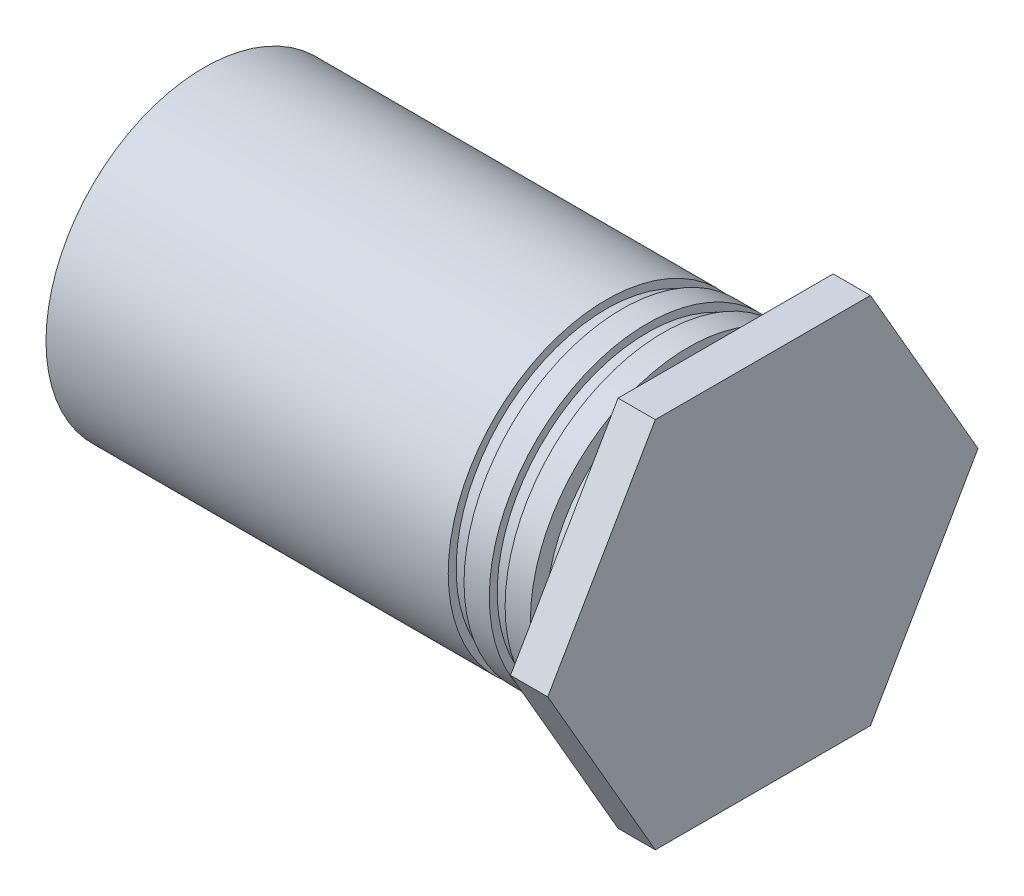
ISO-10303-21;
HEADER;
FILE_DESCRIPTION(('STEP AP214'),'2;1');
FILE_NAME('part.step','',(''),(''),'','','');
FILE_SCHEMA(('AUTOMOTIVE_DESIGN { 1 0 10303 214 1 1 1 1 }'));
ENDSEC;
DATA;
#1=APPLICATION_CONTEXT('core data for automotive mechanical design processes');
#2=APPLICATION_PROTOCOL_DEFINITION('international standard','automotive_design',2000,#1);
#3=PRODUCT_CONTEXT('',#1,'mechanical');
#4=PRODUCT('Part','Part','',(#3));
#5=PRODUCT_RELATED_PRODUCT_CATEGORY('part','',(#4));
#6=PRODUCT_DEFINITION_FORMATION('','',#4);
#7=PRODUCT_DEFINITION_CONTEXT('part definition',#1,'design');
#8=PRODUCT_DEFINITION('design','',#6,#7);
#9=PRODUCT_DEFINITION_SHAPE('','',#8);
#10=(LENGTH_UNIT() NAMED_UNIT(*) SI_UNIT(.MILLI.,.METRE.));
#11=(NAMED_UNIT(*) PLANE_ANGLE_UNIT() SI_UNIT($,.RADIAN.));
#12=(NAMED_UNIT(*) SI_UNIT($,.STERADIAN.) SOLID_ANGLE_UNIT());
#13=UNCERTAINTY_MEASURE_WITH_UNIT(LENGTH_MEASURE(1.E-05),#10,'distance_accuracy_value','');
#14=(GEOMETRIC_REPRESENTATION_CONTEXT(3) GLOBAL_UNCERTAINTY_ASSIGNED_CONTEXT((#13)) GLOBAL_UNIT_ASSIGNED_CONTEXT((#10,
#11,#12)) REPRESENTATION_CONTEXT('',''));
#15=CARTESIAN_POINT('',(0.,0.,0.));
#16=DIRECTION('',(0.,0.,1.));
#17=DIRECTION('',(1.,0.,0.));
#18=AXIS2_PLACEMENT_3D('',#15,#16,#17);
#19=CARTESIAN_POINT('',(0.635,0.,0.));
#20=DIRECTION('',(1.,0.,0.));
#21=DIRECTION('',(0.,1.,0.));
#22=AXIS2_PLACEMENT_3D('',#19,#20,#21);
#23=PLANE('',#22);
#24=DIRECTION('',(0.,0.866025403784438,-0.5));
#25=VECTOR('',#24,1.);
#26=CARTESIAN_POINT('',(0.635,0.,-3.66617420935413));
#27=LINE('',#26,#25);
#28=CARTESIAN_POINT('',(0.635,0.,-3.66617420935413));
#29=VERTEX_POINT('',#28);
#30=CARTESIAN_POINT('',(0.635,-3.175,-1.83308710467706));
#31=VERTEX_POINT('',#30);
#32=EDGE_CURVE('E83',#29,#31,#27,.F.);
#33=ORIENTED_EDGE('',*,*,#32,.F.);
#34=DIRECTION('',(0.,0.866025403784439,0.5));
#35=VECTOR('',#34,1.);
#36=CARTESIAN_POINT('',(0.635,3.175,-1.83308710467706));
#37=LINE('',#36,#35);
#38=CARTESIAN_POINT('',(0.635,3.175,-1.83308710467706));
#39=VERTEX_POINT('',#38);
#40=EDGE_CURVE('E167',#39,#29,#37,.F.);
#41=ORIENTED_EDGE('',*,*,#40,.F.);
#42=DIRECTION('',(0.,0.,1.));
#43=VECTOR('',#42,1.);
#44=CARTESIAN_POINT('',(0.635,3.175,1.83308710467706));
#45=LINE('',#44,#43);
#46=CARTESIAN_POINT('',(0.635,3.175,1.83308710467706));
#47=VERTEX_POINT('',#46);
#48=EDGE_CURVE('E161',#47,#39,#45,.F.);
#49=ORIENTED_EDGE('',*,*,#48,.F.);
#50=DIRECTION('',(0.,-0.866025403784439,0.5));
#51=VECTOR('',#50,1.);
#52=CARTESIAN_POINT('',(0.635,0.,3.66617420935412));
#53=LINE('',#52,#51);
#54=CARTESIAN_POINT('',(0.635,0.,3.66617420935412));
#55=VERTEX_POINT('',#54);
#56=EDGE_CURVE('E72',#55,#47,#53,.F.);
#57=ORIENTED_EDGE('',*,*,#56,.F.);
#58=DIRECTION('',(0.,-0.866025403784439,-0.5));
#59=VECTOR('',#58,1.);
#60=CARTESIAN_POINT('',(0.635,-3.175,1.83308710467706));
#61=LINE('',#60,#59);
#62=CARTESIAN_POINT('',(0.635,-3.175,1.83308710467706));
#63=VERTEX_POINT('',#62);
#64=EDGE_CURVE('E69',#63,#55,#61,.F.);
#65=ORIENTED_EDGE('',*,*,#64,.F.);
#66=DIRECTION('',(0.,0.,-1.));
#67=VECTOR('',#66,1.);
#68=CARTESIAN_POINT('',(0.635,-3.175,-1.83308710467706));
#69=LINE('',#68,#67);
#70=EDGE_CURVE('E66',#31,#63,#69,.F.);
#71=ORIENTED_EDGE('',*,*,#70,.F.);
#72=EDGE_LOOP('',(#33,#41,#49,#57,#65,#71));
#73=FACE_BOUND('',#72,.T.);
#74=ADVANCED_FACE('F17',(#73),#23,.T.);
#75=CARTESIAN_POINT('',(0.,-3.175,1.83308710467706));
#76=DIRECTION('',(0.,-0.5,0.866025403784439));
#77=DIRECTION('',(0.,-0.866025403784439,-0.5));
#78=AXIS2_PLACEMENT_3D('',#75,#76,#77);
#79=PLANE('',#78);
#80=DIRECTION('',(0.,-0.866025403784439,-0.5));
#81=VECTOR('',#80,1.);
#82=CARTESIAN_POINT('',(0.,0.,3.66617420935412));
#83=LINE('',#82,#81);
#84=CARTESIAN_POINT('',(0.,0.,3.66617420935412));
#85=VERTEX_POINT('',#84);
#86=CARTESIAN_POINT('',(0.,-3.175,1.83308710467706));
#87=VERTEX_POINT('',#86);
#88=EDGE_CURVE('E80',#85,#87,#83,.T.);
#89=ORIENTED_EDGE('',*,*,#88,.T.);
#90=DIRECTION('',(1.,0.,0.));
#91=VECTOR('',#90,1.);
#92=CARTESIAN_POINT('',(0.,-3.175,1.83308710467706));
#93=LINE('',#92,#91);
#94=EDGE_CURVE('E77',#63,#87,#93,.F.);
#95=ORIENTED_EDGE('',*,*,#94,.F.);
#96=ORIENTED_EDGE('',*,*,#64,.T.);
#97=DIRECTION('',(1.,0.,0.));
#98=VECTOR('',#97,1.);
#99=CARTESIAN_POINT('',(0.,0.,3.66617420935412));
#100=LINE('',#99,#98);
#101=EDGE_CURVE('E153',#85,#55,#100,.T.);
#102=ORIENTED_EDGE('',*,*,#101,.F.);
#103=EDGE_LOOP('',(#89,#95,#96,#102));
#104=FACE_BOUND('',#103,.T.);
#105=ADVANCED_FACE('F78',(#104),#79,.T.);
#106=CARTESIAN_POINT('',(0.,-3.175,-1.83308710467706));
#107=DIRECTION('',(0.,-1.,0.));
#108=DIRECTION('',(0.,0.,-1.));
#109=AXIS2_PLACEMENT_3D('',#106,#107,#108);
#110=PLANE('',#109);
#111=DIRECTION('',(0.,0.,1.));
#112=VECTOR('',#111,1.);
#113=CARTESIAN_POINT('',(0.,-3.175,0.));
#114=LINE('',#113,#112);
#115=CARTESIAN_POINT('',(0.,-3.175,-1.83308710467706));
#116=VERTEX_POINT('',#115);
#117=EDGE_CURVE('E150',#87,#116,#114,.F.);
#118=ORIENTED_EDGE('',*,*,#117,.T.);
#119=DIRECTION('',(1.,0.,0.));
#120=VECTOR('',#119,1.);
#121=CARTESIAN_POINT('',(0.,-3.175,-1.83308710467707));
#122=LINE('',#121,#120);
#123=EDGE_CURVE('E87',#31,#116,#122,.F.);
#124=ORIENTED_EDGE('',*,*,#123,.F.);
#125=ORIENTED_EDGE('',*,*,#70,.T.);
#126=ORIENTED_EDGE('',*,*,#94,.T.);
#127=EDGE_LOOP('',(#118,#124,#125,#126));
#128=FACE_BOUND('',#127,.T.);
#129=ADVANCED_FACE('F85',(#128),#110,.T.);
#130=CARTESIAN_POINT('',(0.,0.,-3.66617420935413));
#131=DIRECTION('',(0.,-0.5,-0.866025403784438));
#132=DIRECTION('',(0.,0.866025403784438,-0.5));
#133=AXIS2_PLACEMENT_3D('',#130,#131,#132);
#134=PLANE('',#133);
#135=DIRECTION('',(0.,0.866025403784438,-0.500000000000002));
#136=VECTOR('',#135,1.);
#137=CARTESIAN_POINT('',(0.,-3.175,-1.83308710467706));
#138=LINE('',#137,#136);
#139=CARTESIAN_POINT('',(0.,0.,-3.66617420935413));
#140=VERTEX_POINT('',#139);
#141=EDGE_CURVE('E148',#116,#140,#138,.T.);
#142=ORIENTED_EDGE('',*,*,#141,.T.);
#143=DIRECTION('',(1.,0.,0.));
#144=VECTOR('',#143,1.);
#145=CARTESIAN_POINT('',(0.,0.,-3.66617420935412));
#146=LINE('',#145,#144);
#147=EDGE_CURVE('E164',#29,#140,#146,.F.);
#148=ORIENTED_EDGE('',*,*,#147,.F.);
#149=ORIENTED_EDGE('',*,*,#32,.T.);
#150=ORIENTED_EDGE('',*,*,#123,.T.);
#151=EDGE_LOOP('',(#142,#148,#149,#150));
#152=FACE_BOUND('',#151,.T.);
#153=ADVANCED_FACE('F172',(#152),#134,.T.);
#154=CARTESIAN_POINT('',(0.,3.175,-1.83308710467706));
#155=DIRECTION('',(0.,0.5,-0.866025403784439));
#156=DIRECTION('',(0.,0.866025403784439,0.5));
#157=AXIS2_PLACEMENT_3D('',#154,#155,#156);
#158=PLANE('',#157);
#159=DIRECTION('',(0.,0.866025403784438,0.500000000000001));
#160=VECTOR('',#159,1.);
#161=CARTESIAN_POINT('',(0.,0.,-3.66617420935413));
#162=LINE('',#161,#160);
#163=CARTESIAN_POINT('',(0.,3.175,-1.83308710467706));
#164=VERTEX_POINT('',#163);
#165=EDGE_CURVE('E142',#140,#164,#162,.T.);
#166=ORIENTED_EDGE('',*,*,#165,.T.);
#167=DIRECTION('',(1.,0.,0.));
#168=VECTOR('',#167,1.);
#169=CARTESIAN_POINT('',(0.,3.175,-1.83308710467706));
#170=LINE('',#169,#168);
#171=EDGE_CURVE('E158',#39,#164,#170,.F.);
#172=ORIENTED_EDGE('',*,*,#171,.F.);
#173=ORIENTED_EDGE('',*,*,#40,.T.);
#174=ORIENTED_EDGE('',*,*,#147,.T.);
#175=EDGE_LOOP('',(#166,#172,#173,#174));
#176=FACE_BOUND('',#175,.T.);
#177=ADVANCED_FACE('F177',(#176),#158,.T.);
#178=CARTESIAN_POINT('',(0.,3.175,1.83308710467706));
#179=DIRECTION('',(0.,1.,0.));
#180=DIRECTION('',(0.,0.,1.));
#181=AXIS2_PLACEMENT_3D('',#178,#179,#180);
#182=PLANE('',#181);
#183=DIRECTION('',(0.,0.,1.));
#184=VECTOR('',#183,1.);
#185=CARTESIAN_POINT('',(0.,3.175,0.));
#186=LINE('',#185,#184);
#187=CARTESIAN_POINT('',(0.,3.175,1.83308710467706));
#188=VERTEX_POINT('',#187);
#189=EDGE_CURVE('E137',#164,#188,#186,.T.);
#190=ORIENTED_EDGE('',*,*,#189,.T.);
#191=DIRECTION('',(1.,0.,0.));
#192=VECTOR('',#191,1.);
#193=CARTESIAN_POINT('',(0.,3.175,1.83308710467706));
#194=LINE('',#193,#192);
#195=EDGE_CURVE('E155',#47,#188,#194,.F.);
#196=ORIENTED_EDGE('',*,*,#195,.F.);
#197=ORIENTED_EDGE('',*,*,#48,.T.);
#198=ORIENTED_EDGE('',*,*,#171,.T.);
#199=EDGE_LOOP('',(#190,#196,#197,#198));
#200=FACE_BOUND('',#199,.T.);
#201=ADVANCED_FACE('F181',(#200),#182,.T.);
#202=CARTESIAN_POINT('',(0.,0.,3.66617420935412));
#203=DIRECTION('',(0.,0.5,0.866025403784439));
#204=DIRECTION('',(0.,-0.866025403784439,0.5));
#205=AXIS2_PLACEMENT_3D('',#202,#203,#204);
#206=PLANE('',#205);
#207=DIRECTION('',(0.,-0.866025403784439,0.5));
#208=VECTOR('',#207,1.);
#209=CARTESIAN_POINT('',(0.,3.175,1.83308710467706));
#210=LINE('',#209,#208);
#211=EDGE_CURVE('E133',#188,#85,#210,.T.);
#212=ORIENTED_EDGE('',*,*,#211,.T.);
#213=ORIENTED_EDGE('',*,*,#101,.T.);
#214=ORIENTED_EDGE('',*,*,#56,.T.);
#215=ORIENTED_EDGE('',*,*,#195,.T.);
#216=EDGE_LOOP('',(#212,#213,#214,#215));
#217=FACE_BOUND('',#216,.T.);
#218=ADVANCED_FACE('F182',(#217),#206,.T.);
#219=CARTESIAN_POINT('',(0.,0.,0.));
#220=DIRECTION('',(1.,0.,0.));
#221=DIRECTION('',(0.,1.,0.));
#222=AXIS2_PLACEMENT_3D('',#219,#220,#221);
#223=PLANE('',#222);
#224=CARTESIAN_POINT('',(0.,0.,0.));
#225=DIRECTION('',(1.,0.,0.));
#226=DIRECTION('',(0.,0.,-1.));
#227=AXIS2_PLACEMENT_3D('',#224,#225,#226);
#228=CIRCLE('',#227,2.42316);
#229=CARTESIAN_POINT('',(0.,0.,-2.42316));
#230=VERTEX_POINT('',#229);
#231=EDGE_CURVE('E20',#230,#230,#228,.F.);
#232=ORIENTED_EDGE('',*,*,#231,.F.);
#233=EDGE_LOOP('',(#232));
#234=FACE_BOUND('',#233,.T.);
#235=ORIENTED_EDGE('',*,*,#189,.F.);
#236=ORIENTED_EDGE('',*,*,#165,.F.);
#237=ORIENTED_EDGE('',*,*,#141,.F.);
#238=ORIENTED_EDGE('',*,*,#117,.F.);
#239=ORIENTED_EDGE('',*,*,#88,.F.);
#240=ORIENTED_EDGE('',*,*,#211,.F.);
#241=EDGE_LOOP('',(#235,#236,#237,#238,#239,#240));
#242=FACE_BOUND('',#241,.T.);
#243=ADVANCED_FACE('F184',(#234,#242),#223,.F.);
#244=CARTESIAN_POINT('',(-0.3175,0.,0.));
#245=DIRECTION('',(1.,0.,0.));
#246=DIRECTION('',(0.,0.,-1.));
#247=AXIS2_PLACEMENT_3D('',#244,#245,#246);
#248=CYLINDRICAL_SURFACE('',#247,2.42316);
#249=CARTESIAN_POINT('',(-0.635,0.,0.));
#250=DIRECTION('',(1.,0.,0.));
#251=DIRECTION('',(0.,0.,-1.));
#252=AXIS2_PLACEMENT_3D('',#249,#250,#251);
#253=CIRCLE('',#252,2.42316);
#254=CARTESIAN_POINT('',(-0.634999999999999,0.,-2.42316));
#255=VERTEX_POINT('',#254);
#256=EDGE_CURVE('E128',#255,#255,#253,.F.);
#257=ORIENTED_EDGE('',*,*,#256,.F.);
#258=EDGE_LOOP('',(#257));
#259=FACE_BOUND('',#258,.T.);
#260=ORIENTED_EDGE('',*,*,#231,.T.);
#261=EDGE_LOOP('',(#260));
#262=FACE_BOUND('',#261,.T.);
#263=ADVANCED_FACE('F191',(#259,#262),#248,.T.);
#264=CARTESIAN_POINT('',(-0.635,0.,1.3462));
#265=DIRECTION('',(1.,0.,0.));
#266=DIRECTION('',(0.,0.,-1.));
#267=AXIS2_PLACEMENT_3D('',#264,#265,#266);
#268=PLANE('',#267);
#269=CARTESIAN_POINT('',(-0.635000000000001,0.,0.));
#270=DIRECTION('',(1.,0.,0.));
#271=DIRECTION('',(0.,0.,-1.));
#272=AXIS2_PLACEMENT_3D('',#269,#270,#271);
#273=CIRCLE('',#272,2.6924);
#274=CARTESIAN_POINT('',(-0.635,0.,-2.6924));
#275=VERTEX_POINT('',#274);
#276=EDGE_CURVE('E126',#275,#275,#273,.F.);
#277=ORIENTED_EDGE('',*,*,#276,.F.);
#278=EDGE_LOOP('',(#277));
#279=FACE_BOUND('',#278,.T.);
#280=ORIENTED_EDGE('',*,*,#256,.T.);
#281=EDGE_LOOP('',(#280));
#282=FACE_BOUND('',#281,.T.);
#283=ADVANCED_FACE('F258',(#279,#282),#268,.T.);
#284=CARTESIAN_POINT('',(-4.7625,0.,0.));
#285=DIRECTION('',(1.,0.,0.));
#286=DIRECTION('',(0.,0.,-1.));
#287=AXIS2_PLACEMENT_3D('',#284,#285,#286);
#288=CYLINDRICAL_SURFACE('',#287,2.6924);
#289=CARTESIAN_POINT('',(-1.065784,0.,0.));
#290=DIRECTION('',(1.,0.,0.));
#291=DIRECTION('',(0.,0.,-1.));
#292=AXIS2_PLACEMENT_3D('',#289,#290,#291);
#293=CIRCLE('',#292,2.6924);
#294=CARTESIAN_POINT('',(-1.065784,0.,-2.6924));
#295=VERTEX_POINT('',#294);
#296=EDGE_CURVE('E123',#295,#295,#293,.T.);
#297=ORIENTED_EDGE('',*,*,#296,.T.);
#298=EDGE_LOOP('',(#297));
#299=FACE_BOUND('',#298,.T.);
#300=ORIENTED_EDGE('',*,*,#276,.T.);
#301=EDGE_LOOP('',(#300));
#302=FACE_BOUND('',#301,.T.);
#303=ADVANCED_FACE('F254',(#299,#302),#288,.T.);
#304=CARTESIAN_POINT('',(-1.065784,0.,2.62509));
#305=DIRECTION('',(1.,0.,0.));
#306=DIRECTION('',(0.,0.,-1.));
#307=AXIS2_PLACEMENT_3D('',#304,#305,#306);
#308=PLANE('',#307);
#309=ORIENTED_EDGE('',*,*,#296,.F.);
#310=EDGE_LOOP('',(#309));
#311=FACE_BOUND('',#310,.T.);
#312=CARTESIAN_POINT('',(-1.065784,0.,0.));
#313=DIRECTION('',(1.,0.,0.));
#314=DIRECTION('',(0.,0.,-1.));
#315=AXIS2_PLACEMENT_3D('',#312,#313,#314);
#316=CIRCLE('',#315,2.55778);
#317=CARTESIAN_POINT('',(-1.065784,0.,-2.55778));
#318=VERTEX_POINT('',#317);
#319=EDGE_CURVE('E120',#318,#318,#316,.F.);
#320=ORIENTED_EDGE('',*,*,#319,.F.);
#321=EDGE_LOOP('',(#320));
#322=FACE_BOUND('',#321,.T.);
#323=ADVANCED_FACE('F250',(#311,#322),#308,.F.);
#324=CARTESIAN_POINT('',(-1.200404,0.,0.));
#325=DIRECTION('',(1.,0.,0.));
#326=DIRECTION('',(0.,0.,-1.));
#327=AXIS2_PLACEMENT_3D('',#324,#325,#326);
#328=CYLINDRICAL_SURFACE('',#327,2.55778);
#329=CARTESIAN_POINT('',(-1.335024,0.,0.));
#330=DIRECTION('',(1.,0.,0.));
#331=DIRECTION('',(0.,0.,-1.));
#332=AXIS2_PLACEMENT_3D('',#329,#330,#331);
#333=CIRCLE('',#332,2.55778);
#334=CARTESIAN_POINT('',(-1.335024,0.,-2.55778));
#335=VERTEX_POINT('',#334);
#336=EDGE_CURVE('E117',#335,#335,#333,.T.);
#337=ORIENTED_EDGE('',*,*,#336,.T.);
#338=EDGE_LOOP('',(#337));
#339=FACE_BOUND('',#338,.T.);
#340=ORIENTED_EDGE('',*,*,#319,.T.);
#341=EDGE_LOOP('',(#340));
#342=FACE_BOUND('',#341,.T.);
#343=ADVANCED_FACE('F246',(#339,#342),#328,.T.);
#344=CARTESIAN_POINT('',(-2.14630000010629,0.,0.));
#345=DIRECTION('',(-1.,0.,0.));
#346=DIRECTION('',(0.,-1.,0.));
#347=AXIS2_PLACEMENT_3D('',#344,#345,#346);
#348=CONICAL_SURFACE('',#347,1.32334000005585,1.04719755119264);
#349=CARTESIAN_POINT('',(-2.1463,0.,0.));
#350=DIRECTION('',(-1.,0.,0.));
#351=DIRECTION('',(0.,-1.,0.));
#352=AXIS2_PLACEMENT_3D('',#349,#350,#351);
#353=CIRCLE('',#352,1.32334);
#354=CARTESIAN_POINT('',(-2.1463,-1.32334,0.));
#355=VERTEX_POINT('',#354);
#356=EDGE_CURVE('E116',#355,#355,#353,.T.);
#357=ORIENTED_EDGE('',*,*,#356,.T.);
#358=EDGE_LOOP('',(#357));
#359=FACE_BOUND('',#358,.T.);
#360=CARTESIAN_POINT('',(-1.3822692949077,0.,-2.84212926676294E-11));
#361=VERTEX_POINT('',#360);
#362=VERTEX_LOOP('',#361);
#363=FACE_BOUND('',#362,.T.);
#364=ADVANCED_FACE('F242',(#359,#363),#348,.F.);
#365=CARTESIAN_POINT('',(-1.335024,0.,2.62509));
#366=DIRECTION('',(-1.,0.,0.));
#367=DIRECTION('',(0.,0.,1.));
#368=AXIS2_PLACEMENT_3D('',#365,#366,#367);
#369=PLANE('',#368);
#370=ORIENTED_EDGE('',*,*,#336,.F.);
#371=EDGE_LOOP('',(#370));
#372=FACE_BOUND('',#371,.T.);
#373=CARTESIAN_POINT('',(-1.335024,0.,0.));
#374=DIRECTION('',(1.,0.,0.));
#375=DIRECTION('',(0.,0.,-1.));
#376=AXIS2_PLACEMENT_3D('',#373,#374,#375);
#377=CIRCLE('',#376,2.6924);
#378=CARTESIAN_POINT('',(-1.335024,0.,-2.6924));
#379=VERTEX_POINT('',#378);
#380=EDGE_CURVE('E113',#379,#379,#377,.F.);
#381=ORIENTED_EDGE('',*,*,#380,.F.);
#382=EDGE_LOOP('',(#381));
#383=FACE_BOUND('',#382,.T.);
#384=ADVANCED_FACE('F238',(#372,#383),#369,.F.);
#385=CARTESIAN_POINT('',(-3.53695,0.,0.));
#386=DIRECTION('',(-1.,0.,0.));
#387=DIRECTION('',(0.,-1.,0.));
#388=AXIS2_PLACEMENT_3D('',#385,#386,#387);
#389=CYLINDRICAL_SURFACE('',#388,1.32334);
#390=ORIENTED_EDGE('',*,*,#356,.F.);
#391=EDGE_LOOP('',(#390));
#392=FACE_BOUND('',#391,.T.);
#393=CARTESIAN_POINT('',(-4.9276,0.,0.));
#394=DIRECTION('',(-1.,0.,0.));
#395=DIRECTION('',(0.,-1.,0.));
#396=AXIS2_PLACEMENT_3D('',#393,#394,#395);
#397=CIRCLE('',#396,1.32334);
#398=CARTESIAN_POINT('',(-4.9276,-1.32334,0.));
#399=VERTEX_POINT('',#398);
#400=EDGE_CURVE('E110',#399,#399,#397,.F.);
#401=ORIENTED_EDGE('',*,*,#400,.F.);
#402=EDGE_LOOP('',(#401));
#403=FACE_BOUND('',#402,.T.);
#404=ADVANCED_FACE('F234',(#392,#403),#389,.F.);
#405=CARTESIAN_POINT('',(-4.7625,0.,0.));
#406=DIRECTION('',(1.,0.,0.));
#407=DIRECTION('',(0.,0.,-1.));
#408=AXIS2_PLACEMENT_3D('',#405,#406,#407);
#409=CYLINDRICAL_SURFACE('',#408,2.6924);
#410=CARTESIAN_POINT('',(-1.765808,0.,0.));
#411=DIRECTION('',(1.,0.,0.));
#412=DIRECTION('',(0.,0.,-1.));
#413=AXIS2_PLACEMENT_3D('',#410,#411,#412);
#414=CIRCLE('',#413,2.6924);
#415=CARTESIAN_POINT('',(-1.765808,0.,-2.6924));
#416=VERTEX_POINT('',#415);
#417=EDGE_CURVE('E107',#416,#416,#414,.T.);
#418=ORIENTED_EDGE('',*,*,#417,.T.);
#419=EDGE_LOOP('',(#418));
#420=FACE_BOUND('',#419,.T.);
#421=ORIENTED_EDGE('',*,*,#380,.T.);
#422=EDGE_LOOP('',(#421));
#423=FACE_BOUND('',#422,.T.);
#424=ADVANCED_FACE('F230',(#420,#423),#409,.T.);
#425=CARTESIAN_POINT('',(-4.9276,0.,-1.47447));
#426=DIRECTION('',(1.,0.,0.));
#427=DIRECTION('',(0.,1.,0.));
#428=AXIS2_PLACEMENT_3D('',#425,#426,#427);
#429=PLANE('',#428);
#430=ORIENTED_EDGE('',*,*,#400,.T.);
#431=EDGE_LOOP('',(#430));
#432=FACE_BOUND('',#431,.T.);
#433=CARTESIAN_POINT('',(-4.9276,0.,0.));
#434=DIRECTION('',(-1.,0.,0.));
#435=DIRECTION('',(0.,-1.,0.));
#436=AXIS2_PLACEMENT_3D('',#433,#434,#435);
#437=CIRCLE('',#436,1.19634);
#438=CARTESIAN_POINT('',(-4.9276,-1.19634,0.));
#439=VERTEX_POINT('',#438);
#440=EDGE_CURVE('E104',#439,#439,#437,.T.);
#441=ORIENTED_EDGE('',*,*,#440,.T.);
#442=EDGE_LOOP('',(#441));
#443=FACE_BOUND('',#442,.T.);
#444=ADVANCED_FACE('F226',(#432,#443),#429,.T.);
#445=CARTESIAN_POINT('',(-1.765808,0.,2.62509));
#446=DIRECTION('',(1.,0.,0.));
#447=DIRECTION('',(0.,0.,-1.));
#448=AXIS2_PLACEMENT_3D('',#445,#446,#447);
#449=PLANE('',#448);
#450=ORIENTED_EDGE('',*,*,#417,.F.);
#451=EDGE_LOOP('',(#450));
#452=FACE_BOUND('',#451,.T.);
#453=CARTESIAN_POINT('',(-1.765808,0.,0.));
#454=DIRECTION('',(1.,0.,0.));
#455=DIRECTION('',(0.,0.,-1.));
#456=AXIS2_PLACEMENT_3D('',#453,#454,#455);
#457=CIRCLE('',#456,2.55778);
#458=CARTESIAN_POINT('',(-1.765808,0.,-2.55778));
#459=VERTEX_POINT('',#458);
#460=EDGE_CURVE('E101',#459,#459,#457,.F.);
#461=ORIENTED_EDGE('',*,*,#460,.F.);
#462=EDGE_LOOP('',(#461));
#463=FACE_BOUND('',#462,.T.);
#464=ADVANCED_FACE('F222',(#452,#463),#449,.F.);
#465=CARTESIAN_POINT('',(-6.63067,0.,0.));
#466=DIRECTION('',(-1.,0.,0.));
#467=DIRECTION('',(0.,-1.,0.));
#468=AXIS2_PLACEMENT_3D('',#465,#466,#467);
#469=CYLINDRICAL_SURFACE('',#468,1.19634);
#470=CARTESIAN_POINT('',(-8.33373999995501,0.,0.));
#471=DIRECTION('',(-1.,0.,0.));
#472=DIRECTION('',(0.,0.,-1.));
#473=AXIS2_PLACEMENT_3D('',#470,#471,#472);
#474=CIRCLE('',#473,1.19634000003543);
#475=CARTESIAN_POINT('',(-8.33373999995501,0.,-1.19634000003543));
#476=VERTEX_POINT('',#475);
#477=EDGE_CURVE('E100',#476,#476,#474,.T.);
#478=ORIENTED_EDGE('',*,*,#477,.T.);
#479=EDGE_LOOP('',(#478));
#480=FACE_BOUND('',#479,.T.);
#481=ORIENTED_EDGE('',*,*,#440,.F.);
#482=EDGE_LOOP('',(#481));
#483=FACE_BOUND('',#482,.T.);
#484=ADVANCED_FACE('F218',(#480,#483),#469,.F.);
#485=CARTESIAN_POINT('',(-1.900428,0.,0.));
#486=DIRECTION('',(1.,0.,0.));
#487=DIRECTION('',(0.,0.,-1.));
#488=AXIS2_PLACEMENT_3D('',#485,#486,#487);
#489=CYLINDRICAL_SURFACE('',#488,2.55778);
#490=CARTESIAN_POINT('',(-2.035048,0.,0.));
#491=DIRECTION('',(1.,0.,0.));
#492=DIRECTION('',(0.,0.,-1.));
#493=AXIS2_PLACEMENT_3D('',#490,#491,#492);
#494=CIRCLE('',#493,2.55778);
#495=CARTESIAN_POINT('',(-2.035048,0.,-2.55778));
#496=VERTEX_POINT('',#495);
#497=EDGE_CURVE('E97',#496,#496,#494,.T.);
#498=ORIENTED_EDGE('',*,*,#497,.T.);
#499=EDGE_LOOP('',(#498));
#500=FACE_BOUND('',#499,.T.);
#501=ORIENTED_EDGE('',*,*,#460,.T.);
#502=EDGE_LOOP('',(#501));
#503=FACE_BOUND('',#502,.T.);
#504=ADVANCED_FACE('F214',(#500,#503),#489,.T.);
#505=CARTESIAN_POINT('',(-8.88999999995121,0.,0.));
#506=DIRECTION('',(-1.,0.,0.));
#507=DIRECTION('',(0.,0.,1.));
#508=AXIS2_PLACEMENT_3D('',#505,#506,#507);
#509=CONICAL_SURFACE('',#508,1.75260000003163,0.785398163397448);
#510=CARTESIAN_POINT('',(-8.88999999995121,0.,0.));
#511=DIRECTION('',(-1.,0.,0.));
#512=DIRECTION('',(0.,0.,1.));
#513=AXIS2_PLACEMENT_3D('',#510,#511,#512);
#514=CIRCLE('',#513,1.75260000003163);
#515=CARTESIAN_POINT('',(-8.88999999995121,0.,1.75260000003163));
#516=VERTEX_POINT('',#515);
#517=EDGE_CURVE('E94',#516,#516,#514,.F.);
#518=ORIENTED_EDGE('',*,*,#517,.F.);
#519=EDGE_LOOP('',(#518));
#520=FACE_BOUND('',#519,.T.);
#521=ORIENTED_EDGE('',*,*,#477,.F.);
#522=EDGE_LOOP('',(#521));
#523=FACE_BOUND('',#522,.T.);
#524=ADVANCED_FACE('F210',(#520,#523),#509,.F.);
#525=CARTESIAN_POINT('',(-2.035048,0.,2.62509));
#526=DIRECTION('',(-1.,0.,0.));
#527=DIRECTION('',(0.,0.,1.));
#528=AXIS2_PLACEMENT_3D('',#525,#526,#527);
#529=PLANE('',#528);
#530=ORIENTED_EDGE('',*,*,#497,.F.);
#531=EDGE_LOOP('',(#530));
#532=FACE_BOUND('',#531,.T.);
#533=CARTESIAN_POINT('',(-2.035048,0.,0.));
#534=DIRECTION('',(1.,0.,0.));
#535=DIRECTION('',(0.,0.,-1.));
#536=AXIS2_PLACEMENT_3D('',#533,#534,#535);
#537=CIRCLE('',#536,2.6924);
#538=CARTESIAN_POINT('',(-2.035048,0.,-2.6924));
#539=VERTEX_POINT('',#538);
#540=EDGE_CURVE('E26',#539,#539,#537,.F.);
#541=ORIENTED_EDGE('',*,*,#540,.F.);
#542=EDGE_LOOP('',(#541));
#543=FACE_BOUND('',#542,.T.);
#544=ADVANCED_FACE('F203',(#532,#543),#529,.F.);
#545=CARTESIAN_POINT('',(-8.89,0.,1.3462));
#546=DIRECTION('',(-1.,0.,0.));
#547=DIRECTION('',(0.,0.,1.));
#548=AXIS2_PLACEMENT_3D('',#545,#546,#547);
#549=PLANE('',#548);
#550=CARTESIAN_POINT('',(-8.89,0.,0.));
#551=DIRECTION('',(1.,0.,0.));
#552=DIRECTION('',(0.,0.,-1.));
#553=AXIS2_PLACEMENT_3D('',#550,#551,#552);
#554=CIRCLE('',#553,2.6924);
#555=CARTESIAN_POINT('',(-8.89,0.,-2.6924));
#556=VERTEX_POINT('',#555);
#557=EDGE_CURVE('E10',#556,#556,#554,.T.);
#558=ORIENTED_EDGE('',*,*,#557,.F.);
#559=EDGE_LOOP('',(#558));
#560=FACE_BOUND('',#559,.T.);
#561=ORIENTED_EDGE('',*,*,#517,.T.);
#562=EDGE_LOOP('',(#561));
#563=FACE_BOUND('',#562,.T.);
#564=ADVANCED_FACE('F197',(#560,#563),#549,.T.);
#565=CARTESIAN_POINT('',(-4.7625,0.,0.));
#566=DIRECTION('',(1.,0.,0.));
#567=DIRECTION('',(0.,0.,-1.));
#568=AXIS2_PLACEMENT_3D('',#565,#566,#567);
#569=CYLINDRICAL_SURFACE('',#568,2.6924);
#570=ORIENTED_EDGE('',*,*,#540,.T.);
#571=EDGE_LOOP('',(#570));
#572=FACE_BOUND('',#571,.T.);
#573=ORIENTED_EDGE('',*,*,#557,.T.);
#574=EDGE_LOOP('',(#573));
#575=FACE_BOUND('',#574,.T.);
#576=ADVANCED_FACE('F195',(#572,#575),#569,.T.);
#577=CLOSED_SHELL('',(#74,#105,#129,#153,#177,#201,#218,#243,#263,#283,#303,#323,#343,#364,#384,
#404,#424,#444,#464,#484,#504,#524,#544,#564,#576));
#578=MANIFOLD_SOLID_BREP('B1',#577);
#579=ADVANCED_BREP_SHAPE_REPRESENTATION('',(#18,#578),#14);
#580=SHAPE_DEFINITION_REPRESENTATION(#9,#579);
ENDSEC;
END-ISO-10303-21;
